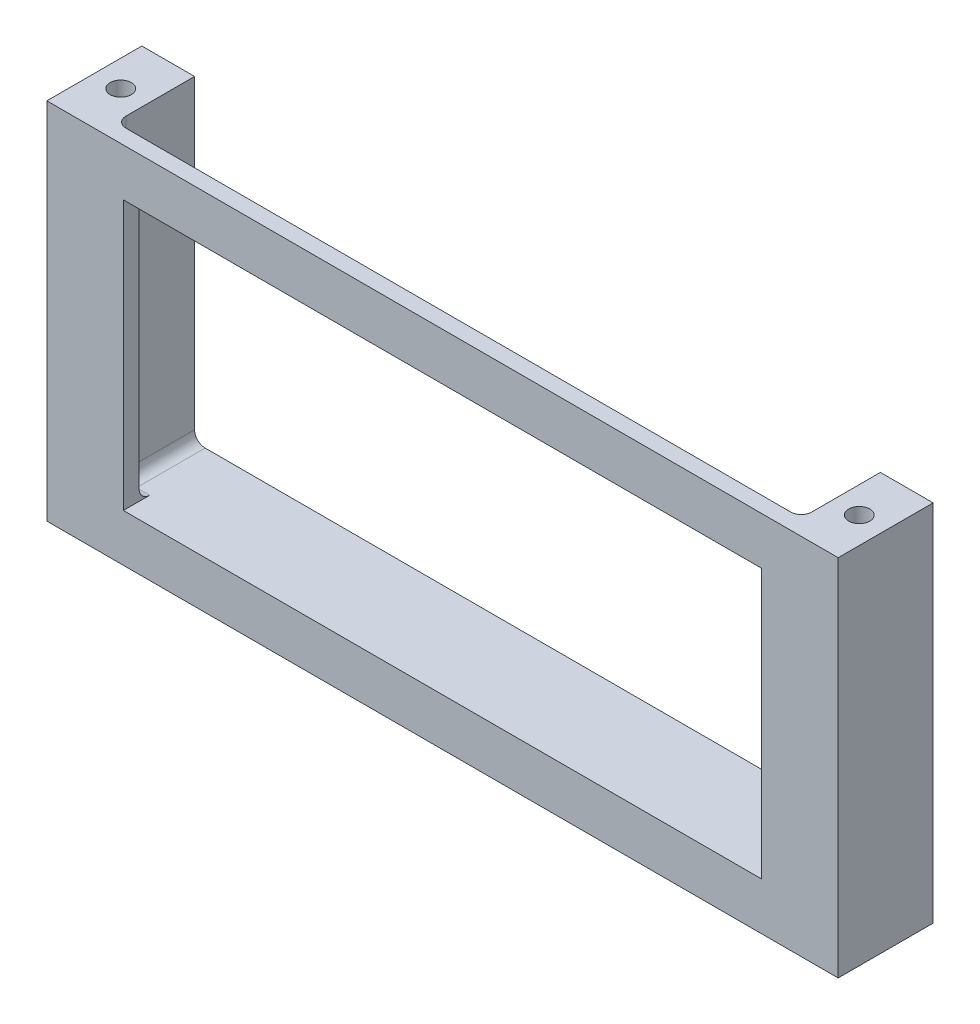
ISO-10303-21;
HEADER;
FILE_DESCRIPTION(('STEP AP214'),'2;1');
FILE_NAME('part.step','',(''),(''),'','','');
FILE_SCHEMA(('AUTOMOTIVE_DESIGN { 1 0 10303 214 1 1 1 1 }'));
ENDSEC;
DATA;
#1=APPLICATION_CONTEXT('core data for automotive mechanical design processes');
#2=APPLICATION_PROTOCOL_DEFINITION('international standard','automotive_design',2000,#1);
#3=PRODUCT_CONTEXT('',#1,'mechanical');
#4=PRODUCT('Part','Part','',(#3));
#5=PRODUCT_RELATED_PRODUCT_CATEGORY('part','',(#4));
#6=PRODUCT_DEFINITION_FORMATION('','',#4);
#7=PRODUCT_DEFINITION_CONTEXT('part definition',#1,'design');
#8=PRODUCT_DEFINITION('design','',#6,#7);
#9=PRODUCT_DEFINITION_SHAPE('','',#8);
#10=(LENGTH_UNIT() NAMED_UNIT(*) SI_UNIT(.MILLI.,.METRE.));
#11=(NAMED_UNIT(*) PLANE_ANGLE_UNIT() SI_UNIT($,.RADIAN.));
#12=(NAMED_UNIT(*) SI_UNIT($,.STERADIAN.) SOLID_ANGLE_UNIT());
#13=UNCERTAINTY_MEASURE_WITH_UNIT(LENGTH_MEASURE(1.E-05),#10,'distance_accuracy_value','');
#14=(GEOMETRIC_REPRESENTATION_CONTEXT(3) GLOBAL_UNCERTAINTY_ASSIGNED_CONTEXT((#13)) GLOBAL_UNIT_ASSIGNED_CONTEXT((#10,
#11,#12)) REPRESENTATION_CONTEXT('',''));
#15=CARTESIAN_POINT('',(0.,0.,0.));
#16=DIRECTION('',(0.,0.,1.));
#17=DIRECTION('',(1.,0.,0.));
#18=AXIS2_PLACEMENT_3D('',#15,#16,#17);
#19=CARTESIAN_POINT('',(65.,69.,1.49999999999999));
#20=DIRECTION('',(0.,0.,-1.));
#21=DIRECTION('',(-1.,0.,0.));
#22=AXIS2_PLACEMENT_3D('',#19,#20,#21);
#23=PLANE('',#22);
#24=DIRECTION('',(0.,1.,0.));
#25=VECTOR('',#24,1.);
#26=CARTESIAN_POINT('',(-75.0000000000001,69.,1.50000000000001));
#27=LINE('',#26,#25);
#28=CARTESIAN_POINT('',(-75.0000000000001,0.,1.50000000000001));
#29=VERTEX_POINT('',#28);
#30=CARTESIAN_POINT('',(-75.0000000000001,69.,1.50000000000001));
#31=VERTEX_POINT('',#30);
#32=EDGE_CURVE('E171',#29,#31,#27,.T.);
#33=ORIENTED_EDGE('',*,*,#32,.F.);
#34=DIRECTION('',(1.,0.,0.));
#35=VECTOR('',#34,1.);
#36=CARTESIAN_POINT('',(65.,0.,1.49999999999999));
#37=LINE('',#36,#35);
#38=CARTESIAN_POINT('',(75.,0.,1.49999999999999));
#39=VERTEX_POINT('',#38);
#40=EDGE_CURVE('E258',#29,#39,#37,.T.);
#41=ORIENTED_EDGE('',*,*,#40,.T.);
#42=DIRECTION('',(0.,-1.,0.));
#43=VECTOR('',#42,1.);
#44=CARTESIAN_POINT('',(75.,0.,1.49999999999999));
#45=LINE('',#44,#43);
#46=CARTESIAN_POINT('',(74.9999999999999,69.,1.49999999999999));
#47=VERTEX_POINT('',#46);
#48=EDGE_CURVE('E174',#47,#39,#45,.T.);
#49=ORIENTED_EDGE('',*,*,#48,.F.);
#50=DIRECTION('',(1.,0.,0.));
#51=VECTOR('',#50,1.);
#52=CARTESIAN_POINT('',(65.,69.,1.49999999999999));
#53=LINE('',#52,#51);
#54=EDGE_CURVE('E268',#31,#47,#53,.T.);
#55=ORIENTED_EDGE('',*,*,#54,.F.);
#56=EDGE_LOOP('',(#33,#41,#49,#55));
#57=FACE_BOUND('',#56,.T.);
#58=DIRECTION('',(1.,0.,0.));
#59=VECTOR('',#58,1.);
#60=CARTESIAN_POINT('',(60.5,9.00000000000002,1.5));
#61=LINE('',#60,#59);
#62=CARTESIAN_POINT('',(-60.5,9.00000000000001,1.50000000000001));
#63=VERTEX_POINT('',#62);
#64=CARTESIAN_POINT('',(60.5,9.00000000000002,1.5));
#65=VERTEX_POINT('',#64);
#66=EDGE_CURVE('E242',#63,#65,#61,.T.);
#67=ORIENTED_EDGE('',*,*,#66,.F.);
#68=DIRECTION('',(0.,-1.,0.));
#69=VECTOR('',#68,1.);
#70=CARTESIAN_POINT('',(-60.5,60.,1.5));
#71=LINE('',#70,#69);
#72=CARTESIAN_POINT('',(-60.5,60.,1.5));
#73=VERTEX_POINT('',#72);
#74=EDGE_CURVE('E228',#73,#63,#71,.T.);
#75=ORIENTED_EDGE('',*,*,#74,.F.);
#76=DIRECTION('',(-1.,0.,0.));
#77=VECTOR('',#76,1.);
#78=CARTESIAN_POINT('',(60.5,60.,1.5));
#79=LINE('',#78,#77);
#80=CARTESIAN_POINT('',(60.5,60.,1.5));
#81=VERTEX_POINT('',#80);
#82=EDGE_CURVE('E250',#81,#73,#79,.T.);
#83=ORIENTED_EDGE('',*,*,#82,.F.);
#84=DIRECTION('',(0.,1.,0.));
#85=VECTOR('',#84,1.);
#86=CARTESIAN_POINT('',(60.5,60.,1.5));
#87=LINE('',#86,#85);
#88=EDGE_CURVE('E246',#65,#81,#87,.T.);
#89=ORIENTED_EDGE('',*,*,#88,.F.);
#90=EDGE_LOOP('',(#67,#75,#83,#89));
#91=FACE_BOUND('',#90,.T.);
#92=ADVANCED_FACE('F41',(#57,#91),#23,.F.);
#93=CARTESIAN_POINT('',(65.,69.,-1.50000000000001));
#94=DIRECTION('',(0.,0.,1.));
#95=DIRECTION('',(1.,0.,0.));
#96=AXIS2_PLACEMENT_3D('',#93,#94,#95);
#97=PLANE('',#96);
#98=DIRECTION('',(0.,-1.,0.));
#99=VECTOR('',#98,1.);
#100=CARTESIAN_POINT('',(-60.5,69.,-1.49999999999999));
#101=LINE('',#100,#99);
#102=CARTESIAN_POINT('',(-60.5,60.,-1.5));
#103=VERTEX_POINT('',#102);
#104=CARTESIAN_POINT('',(-60.5,11.,-1.49999999999999));
#105=VERTEX_POINT('',#104);
#106=EDGE_CURVE('E283',#103,#105,#101,.T.);
#107=ORIENTED_EDGE('',*,*,#106,.T.);
#108=DIRECTION('',(-1.,0.,0.));
#109=VECTOR('',#108,1.);
#110=CARTESIAN_POINT('',(-63.,11.,-1.49999999999999));
#111=LINE('',#110,#109);
#112=CARTESIAN_POINT('',(-63.0000000000001,11.,-1.49999999999999));
#113=VERTEX_POINT('',#112);
#114=EDGE_CURVE('E316',#105,#113,#111,.T.);
#115=ORIENTED_EDGE('',*,*,#114,.T.);
#116=DIRECTION('',(0.,-1.,0.));
#117=VECTOR('',#116,1.);
#118=CARTESIAN_POINT('',(-63.,69.,-1.49999999999999));
#119=LINE('',#118,#117);
#120=CARTESIAN_POINT('',(-63.,69.,-1.49999999999999));
#121=VERTEX_POINT('',#120);
#122=EDGE_CURVE('E313',#113,#121,#119,.F.);
#123=ORIENTED_EDGE('',*,*,#122,.T.);
#124=DIRECTION('',(-1.,0.,0.));
#125=VECTOR('',#124,1.);
#126=CARTESIAN_POINT('',(65.,69.,-1.50000000000001));
#127=LINE('',#126,#125);
#128=CARTESIAN_POINT('',(62.9999999999999,69.,-1.50000000000001));
#129=VERTEX_POINT('',#128);
#130=EDGE_CURVE('E271',#129,#121,#127,.T.);
#131=ORIENTED_EDGE('',*,*,#130,.F.);
#132=DIRECTION('',(0.,-1.,0.));
#133=VECTOR('',#132,1.);
#134=CARTESIAN_POINT('',(62.9999999999999,69.,-1.50000000000001));
#135=LINE('',#134,#133);
#136=CARTESIAN_POINT('',(62.9999999999999,11.,-1.50000000000001));
#137=VERTEX_POINT('',#136);
#138=EDGE_CURVE('E306',#129,#137,#135,.T.);
#139=ORIENTED_EDGE('',*,*,#138,.T.);
#140=DIRECTION('',(-1.,0.,0.));
#141=VECTOR('',#140,1.);
#142=CARTESIAN_POINT('',(60.5,11.,-1.50000000000001));
#143=LINE('',#142,#141);
#144=CARTESIAN_POINT('',(60.5,11.,-1.50000000000001));
#145=VERTEX_POINT('',#144);
#146=EDGE_CURVE('E309',#137,#145,#143,.T.);
#147=ORIENTED_EDGE('',*,*,#146,.T.);
#148=DIRECTION('',(0.,1.,0.));
#149=VECTOR('',#148,1.);
#150=CARTESIAN_POINT('',(60.5,69.,-1.50000000000001));
#151=LINE('',#150,#149);
#152=CARTESIAN_POINT('',(60.5,60.,-1.50000000000001));
#153=VERTEX_POINT('',#152);
#154=EDGE_CURVE('E274',#145,#153,#151,.T.);
#155=ORIENTED_EDGE('',*,*,#154,.T.);
#156=DIRECTION('',(-1.,0.,0.));
#157=VECTOR('',#156,1.);
#158=CARTESIAN_POINT('',(65.,60.,-1.50000000000001));
#159=LINE('',#158,#157);
#160=EDGE_CURVE('E279',#153,#103,#159,.T.);
#161=ORIENTED_EDGE('',*,*,#160,.T.);
#162=EDGE_LOOP('',(#107,#115,#123,#131,#139,#147,#155,#161));
#163=FACE_BOUND('',#162,.T.);
#164=ADVANCED_FACE('F372',(#163),#97,.F.);
#165=CARTESIAN_POINT('',(0.,69.,0.));
#166=DIRECTION('',(0.,-1.,0.));
#167=DIRECTION('',(0.,0.,-1.));
#168=AXIS2_PLACEMENT_3D('',#165,#166,#167);
#169=PLANE('',#168);
#170=CARTESIAN_POINT('',(-70.0000000000001,69.,-7.50000000000001));
#171=DIRECTION('',(0.,1.,0.));
#172=DIRECTION('',(0.,0.,1.));
#173=AXIS2_PLACEMENT_3D('',#170,#171,#172);
#174=CIRCLE('',#173,2.);
#175=CARTESIAN_POINT('',(-70.0000000000001,69.,-5.50000000000001));
#176=VERTEX_POINT('',#175);
#177=EDGE_CURVE('E195',#176,#176,#174,.T.);
#178=ORIENTED_EDGE('',*,*,#177,.F.);
#179=EDGE_LOOP('',(#178));
#180=FACE_BOUND('',#179,.T.);
#181=CARTESIAN_POINT('',(70.0000000000001,69.,-7.50000000000001));
#182=DIRECTION('',(0.,1.,0.));
#183=DIRECTION('',(0.,0.,-1.));
#184=AXIS2_PLACEMENT_3D('',#181,#182,#183);
#185=CIRCLE('',#184,2.);
#186=CARTESIAN_POINT('',(70.0000000000001,69.,-9.50000000000001));
#187=VERTEX_POINT('',#186);
#188=EDGE_CURVE('E198',#187,#187,#185,.T.);
#189=ORIENTED_EDGE('',*,*,#188,.F.);
#190=EDGE_LOOP('',(#189));
#191=FACE_BOUND('',#190,.T.);
#192=DIRECTION('',(0.,0.,-1.));
#193=VECTOR('',#192,1.);
#194=CARTESIAN_POINT('',(64.9999999999999,69.,1.49999999999999));
#195=LINE('',#194,#193);
#196=CARTESIAN_POINT('',(64.9999999999999,69.,-3.50000000000001));
#197=VERTEX_POINT('',#196);
#198=CARTESIAN_POINT('',(64.9999999999999,69.,-16.5));
#199=VERTEX_POINT('',#198);
#200=EDGE_CURVE('E235',#197,#199,#195,.T.);
#201=ORIENTED_EDGE('',*,*,#200,.F.);
#202=CARTESIAN_POINT('',(62.9999999999999,69.,-3.50000000000001));
#203=DIRECTION('',(0.,-1.,0.));
#204=DIRECTION('',(0.,0.,-1.));
#205=AXIS2_PLACEMENT_3D('',#202,#203,#204);
#206=CIRCLE('',#205,2.);
#207=EDGE_CURVE('E11',#197,#129,#206,.T.);
#208=ORIENTED_EDGE('',*,*,#207,.T.);
#209=ORIENTED_EDGE('',*,*,#130,.T.);
#210=CARTESIAN_POINT('',(-63.0000000000001,69.,-3.49999999999999));
#211=DIRECTION('',(0.,-1.,0.));
#212=DIRECTION('',(0.,0.,-1.));
#213=AXIS2_PLACEMENT_3D('',#210,#211,#212);
#214=CIRCLE('',#213,2.);
#215=CARTESIAN_POINT('',(-65.0000000000001,69.,-3.49999999999999));
#216=VERTEX_POINT('',#215);
#217=EDGE_CURVE('E51',#121,#216,#214,.T.);
#218=ORIENTED_EDGE('',*,*,#217,.T.);
#219=DIRECTION('',(0.,0.,-1.));
#220=VECTOR('',#219,1.);
#221=CARTESIAN_POINT('',(-65.0000000000001,69.,1.50000000000001));
#222=LINE('',#221,#220);
#223=CARTESIAN_POINT('',(-65.0000000000001,69.,-16.5));
#224=VERTEX_POINT('',#223);
#225=EDGE_CURVE('E173',#216,#224,#222,.T.);
#226=ORIENTED_EDGE('',*,*,#225,.T.);
#227=DIRECTION('',(1.,0.,0.));
#228=VECTOR('',#227,1.);
#229=CARTESIAN_POINT('',(-65.0000000000001,69.,-16.5));
#230=LINE('',#229,#228);
#231=CARTESIAN_POINT('',(-75.0000000000001,69.,-16.5));
#232=VERTEX_POINT('',#231);
#233=EDGE_CURVE('E177',#232,#224,#230,.T.);
#234=ORIENTED_EDGE('',*,*,#233,.F.);
#235=DIRECTION('',(0.,0.,-1.));
#236=VECTOR('',#235,1.);
#237=CARTESIAN_POINT('',(-75.0000000000001,69.,1.50000000000001));
#238=LINE('',#237,#236);
#239=EDGE_CURVE('E164',#31,#232,#238,.T.);
#240=ORIENTED_EDGE('',*,*,#239,.F.);
#241=ORIENTED_EDGE('',*,*,#54,.T.);
#242=DIRECTION('',(0.,0.,-1.));
#243=VECTOR('',#242,1.);
#244=CARTESIAN_POINT('',(74.9999999999999,69.,1.49999999999999));
#245=LINE('',#244,#243);
#246=CARTESIAN_POINT('',(74.9999999999999,69.,-16.5));
#247=VERTEX_POINT('',#246);
#248=EDGE_CURVE('E232',#47,#247,#245,.T.);
#249=ORIENTED_EDGE('',*,*,#248,.T.);
#250=DIRECTION('',(1.,0.,0.));
#251=VECTOR('',#250,1.);
#252=CARTESIAN_POINT('',(74.9999999999999,69.,-16.5));
#253=LINE('',#252,#251);
#254=EDGE_CURVE('E211',#199,#247,#253,.T.);
#255=ORIENTED_EDGE('',*,*,#254,.F.);
#256=EDGE_LOOP('',(#201,#208,#209,#218,#226,#234,#240,#241,#249,#255));
#257=FACE_BOUND('',#256,.T.);
#258=ADVANCED_FACE('F178',(#180,#191,#257),#169,.F.);
#259=CARTESIAN_POINT('',(0.,0.,0.));
#260=DIRECTION('',(0.,-1.,0.));
#261=DIRECTION('',(0.,0.,-1.));
#262=AXIS2_PLACEMENT_3D('',#259,#260,#261);
#263=PLANE('',#262);
#264=CARTESIAN_POINT('',(-70.0000000000001,0.,-7.50000000000001));
#265=DIRECTION('',(0.,1.,0.));
#266=DIRECTION('',(0.,0.,1.));
#267=AXIS2_PLACEMENT_3D('',#264,#265,#266);
#268=CIRCLE('',#267,2.);
#269=CARTESIAN_POINT('',(-70.0000000000001,0.,-5.50000000000001));
#270=VERTEX_POINT('',#269);
#271=EDGE_CURVE('E191',#270,#270,#268,.T.);
#272=ORIENTED_EDGE('',*,*,#271,.T.);
#273=EDGE_LOOP('',(#272));
#274=FACE_BOUND('',#273,.T.);
#275=CARTESIAN_POINT('',(70.0000000000001,0.,-7.50000000000001));
#276=DIRECTION('',(0.,1.,0.));
#277=DIRECTION('',(0.,0.,-1.));
#278=AXIS2_PLACEMENT_3D('',#275,#276,#277);
#279=CIRCLE('',#278,2.);
#280=CARTESIAN_POINT('',(70.0000000000001,0.,-9.50000000000001));
#281=VERTEX_POINT('',#280);
#282=EDGE_CURVE('E600',#281,#281,#279,.T.);
#283=ORIENTED_EDGE('',*,*,#282,.T.);
#284=EDGE_LOOP('',(#283));
#285=FACE_BOUND('',#284,.T.);
#286=ORIENTED_EDGE('',*,*,#40,.F.);
#287=DIRECTION('',(0.,0.,-1.));
#288=VECTOR('',#287,1.);
#289=CARTESIAN_POINT('',(-75.0000000000001,0.,1.50000000000001));
#290=LINE('',#289,#288);
#291=CARTESIAN_POINT('',(-75.0000000000001,0.,-16.5));
#292=VERTEX_POINT('',#291);
#293=EDGE_CURVE('E225',#29,#292,#290,.T.);
#294=ORIENTED_EDGE('',*,*,#293,.T.);
#295=DIRECTION('',(-1.,0.,0.));
#296=VECTOR('',#295,1.);
#297=CARTESIAN_POINT('',(-75.0000000000001,0.,-16.5));
#298=LINE('',#297,#296);
#299=CARTESIAN_POINT('',(75.,0.,-16.5));
#300=VERTEX_POINT('',#299);
#301=EDGE_CURVE('E189',#300,#292,#298,.T.);
#302=ORIENTED_EDGE('',*,*,#301,.F.);
#303=DIRECTION('',(0.,0.,-1.));
#304=VECTOR('',#303,1.);
#305=CARTESIAN_POINT('',(75.,0.,1.49999999999999));
#306=LINE('',#305,#304);
#307=EDGE_CURVE('E229',#39,#300,#306,.T.);
#308=ORIENTED_EDGE('',*,*,#307,.F.);
#309=EDGE_LOOP('',(#286,#294,#302,#308));
#310=FACE_BOUND('',#309,.T.);
#311=ADVANCED_FACE('F535',(#274,#285,#310),#263,.T.);
#312=CARTESIAN_POINT('',(-60.5,60.,-63.5));
#313=DIRECTION('',(-1.,0.,0.));
#314=DIRECTION('',(0.,-1.,0.));
#315=AXIS2_PLACEMENT_3D('',#312,#313,#314);
#316=PLANE('',#315);
#317=DIRECTION('',(0.,0.,1.));
#318=VECTOR('',#317,1.);
#319=CARTESIAN_POINT('',(-60.5,60.,-63.5));
#320=LINE('',#319,#318);
#321=EDGE_CURVE('E255',#103,#73,#320,.T.);
#322=ORIENTED_EDGE('',*,*,#321,.T.);
#323=ORIENTED_EDGE('',*,*,#74,.T.);
#324=DIRECTION('',(0.,0.,1.));
#325=VECTOR('',#324,1.);
#326=CARTESIAN_POINT('',(-60.5,9.00000000000001,-63.5));
#327=LINE('',#326,#325);
#328=CARTESIAN_POINT('',(-60.5,9.00000000000001,-3.5));
#329=VERTEX_POINT('',#328);
#330=EDGE_CURVE('E254',#329,#63,#327,.T.);
#331=ORIENTED_EDGE('',*,*,#330,.F.);
#332=CARTESIAN_POINT('',(-60.5,11.,-3.49999999999999));
#333=DIRECTION('',(-1.,0.,0.));
#334=DIRECTION('',(0.,-1.,0.));
#335=AXIS2_PLACEMENT_3D('',#332,#333,#334);
#336=CIRCLE('',#335,2.);
#337=EDGE_CURVE('E338',#329,#105,#336,.T.);
#338=ORIENTED_EDGE('',*,*,#337,.T.);
#339=ORIENTED_EDGE('',*,*,#106,.F.);
#340=EDGE_LOOP('',(#322,#323,#331,#338,#339));
#341=FACE_BOUND('',#340,.T.);
#342=ADVANCED_FACE('F530',(#341),#316,.F.);
#343=CARTESIAN_POINT('',(60.5,60.,-63.5));
#344=DIRECTION('',(0.,1.,0.));
#345=DIRECTION('',(-1.,0.,0.));
#346=AXIS2_PLACEMENT_3D('',#343,#344,#345);
#347=PLANE('',#346);
#348=DIRECTION('',(0.,0.,1.));
#349=VECTOR('',#348,1.);
#350=CARTESIAN_POINT('',(60.5,60.,-63.5));
#351=LINE('',#350,#349);
#352=EDGE_CURVE('E259',#153,#81,#351,.T.);
#353=ORIENTED_EDGE('',*,*,#352,.T.);
#354=ORIENTED_EDGE('',*,*,#82,.T.);
#355=ORIENTED_EDGE('',*,*,#321,.F.);
#356=ORIENTED_EDGE('',*,*,#160,.F.);
#357=EDGE_LOOP('',(#353,#354,#355,#356));
#358=FACE_BOUND('',#357,.T.);
#359=ADVANCED_FACE('F522',(#358),#347,.F.);
#360=CARTESIAN_POINT('',(60.5,60.,-63.5));
#361=DIRECTION('',(1.,0.,0.));
#362=DIRECTION('',(0.,1.,0.));
#363=AXIS2_PLACEMENT_3D('',#360,#361,#362);
#364=PLANE('',#363);
#365=DIRECTION('',(0.,0.,1.));
#366=VECTOR('',#365,1.);
#367=CARTESIAN_POINT('',(60.5,9.00000000000002,-63.5));
#368=LINE('',#367,#366);
#369=CARTESIAN_POINT('',(60.5,9.00000000000002,-3.50000000000001));
#370=VERTEX_POINT('',#369);
#371=EDGE_CURVE('E262',#370,#65,#368,.T.);
#372=ORIENTED_EDGE('',*,*,#371,.T.);
#373=ORIENTED_EDGE('',*,*,#88,.T.);
#374=ORIENTED_EDGE('',*,*,#352,.F.);
#375=ORIENTED_EDGE('',*,*,#154,.F.);
#376=CARTESIAN_POINT('',(60.5,11.,-3.50000000000001));
#377=DIRECTION('',(1.,0.,0.));
#378=DIRECTION('',(0.,1.,0.));
#379=AXIS2_PLACEMENT_3D('',#376,#377,#378);
#380=CIRCLE('',#379,2.);
#381=EDGE_CURVE('E341',#145,#370,#380,.T.);
#382=ORIENTED_EDGE('',*,*,#381,.T.);
#383=EDGE_LOOP('',(#372,#373,#374,#375,#382));
#384=FACE_BOUND('',#383,.T.);
#385=ADVANCED_FACE('F405',(#384),#364,.F.);
#386=CARTESIAN_POINT('',(60.5,9.00000000000002,-63.5));
#387=DIRECTION('',(0.,-1.,0.));
#388=DIRECTION('',(1.,0.,0.));
#389=AXIS2_PLACEMENT_3D('',#386,#387,#388);
#390=PLANE('',#389);
#391=DIRECTION('',(0.,0.,-1.));
#392=VECTOR('',#391,1.);
#393=CARTESIAN_POINT('',(-63.0000000000001,9.00000000000001,-63.5));
#394=LINE('',#393,#392);
#395=CARTESIAN_POINT('',(-63.0000000000001,9.00000000000001,-16.5));
#396=VERTEX_POINT('',#395);
#397=CARTESIAN_POINT('',(-63.0000000000001,9.00000000000001,-3.49999999999999));
#398=VERTEX_POINT('',#397);
#399=EDGE_CURVE('E287',#396,#398,#394,.F.);
#400=ORIENTED_EDGE('',*,*,#399,.T.);
#401=DIRECTION('',(-1.,0.,0.));
#402=VECTOR('',#401,1.);
#403=CARTESIAN_POINT('',(-60.5,9.00000000000001,-3.49999999999999));
#404=LINE('',#403,#402);
#405=EDGE_CURVE('E323',#398,#329,#404,.F.);
#406=ORIENTED_EDGE('',*,*,#405,.T.);
#407=ORIENTED_EDGE('',*,*,#330,.T.);
#408=ORIENTED_EDGE('',*,*,#66,.T.);
#409=ORIENTED_EDGE('',*,*,#371,.F.);
#410=DIRECTION('',(-1.,0.,0.));
#411=VECTOR('',#410,1.);
#412=CARTESIAN_POINT('',(62.9999999999999,9.00000000000002,-3.50000000000001));
#413=LINE('',#412,#411);
#414=CARTESIAN_POINT('',(62.9999999999999,9.00000000000002,-3.50000000000001));
#415=VERTEX_POINT('',#414);
#416=EDGE_CURVE('E320',#370,#415,#413,.F.);
#417=ORIENTED_EDGE('',*,*,#416,.T.);
#418=DIRECTION('',(0.,0.,-1.));
#419=VECTOR('',#418,1.);
#420=CARTESIAN_POINT('',(62.9999999999999,9.00000000000002,-63.5));
#421=LINE('',#420,#419);
#422=CARTESIAN_POINT('',(62.9999999999999,9.00000000000001,-16.5));
#423=VERTEX_POINT('',#422);
#424=EDGE_CURVE('E291',#415,#423,#421,.T.);
#425=ORIENTED_EDGE('',*,*,#424,.T.);
#426=DIRECTION('',(1.,0.,0.));
#427=VECTOR('',#426,1.);
#428=CARTESIAN_POINT('',(64.9999999999999,9.00000000000001,-16.5));
#429=LINE('',#428,#427);
#430=EDGE_CURVE('E203',#396,#423,#429,.T.);
#431=ORIENTED_EDGE('',*,*,#430,.F.);
#432=EDGE_LOOP('',(#400,#406,#407,#408,#409,#417,#425,#431));
#433=FACE_BOUND('',#432,.T.);
#434=ADVANCED_FACE('F389',(#433),#390,.F.);
#435=CARTESIAN_POINT('',(64.9999999999999,69.,1.49999999999999));
#436=DIRECTION('',(-1.,0.,0.));
#437=DIRECTION('',(0.,-1.,0.));
#438=AXIS2_PLACEMENT_3D('',#435,#436,#437);
#439=PLANE('',#438);
#440=DIRECTION('',(0.,0.,-1.));
#441=VECTOR('',#440,1.);
#442=CARTESIAN_POINT('',(64.9999999999999,11.,1.49999999999999));
#443=LINE('',#442,#441);
#444=CARTESIAN_POINT('',(64.9999999999999,11.,-16.5));
#445=VERTEX_POINT('',#444);
#446=CARTESIAN_POINT('',(64.9999999999999,11.,-3.50000000000001));
#447=VERTEX_POINT('',#446);
#448=EDGE_CURVE('E294',#445,#447,#443,.F.);
#449=ORIENTED_EDGE('',*,*,#448,.T.);
#450=DIRECTION('',(0.,-1.,0.));
#451=VECTOR('',#450,1.);
#452=CARTESIAN_POINT('',(64.9999999999999,69.,-3.50000000000001));
#453=LINE('',#452,#451);
#454=EDGE_CURVE('E59',#447,#197,#453,.F.);
#455=ORIENTED_EDGE('',*,*,#454,.T.);
#456=ORIENTED_EDGE('',*,*,#200,.T.);
#457=DIRECTION('',(0.,1.,0.));
#458=VECTOR('',#457,1.);
#459=CARTESIAN_POINT('',(64.9999999999999,69.,-16.5));
#460=LINE('',#459,#458);
#461=EDGE_CURVE('E207',#445,#199,#460,.T.);
#462=ORIENTED_EDGE('',*,*,#461,.F.);
#463=EDGE_LOOP('',(#449,#455,#456,#462));
#464=FACE_BOUND('',#463,.T.);
#465=ADVANCED_FACE('F397',(#464),#439,.T.);
#466=CARTESIAN_POINT('',(-65.0000000000001,9.00000000000001,1.50000000000001));
#467=DIRECTION('',(1.,0.,0.));
#468=DIRECTION('',(0.,0.,-1.));
#469=AXIS2_PLACEMENT_3D('',#466,#467,#468);
#470=PLANE('',#469);
#471=ORIENTED_EDGE('',*,*,#225,.F.);
#472=DIRECTION('',(0.,-1.,0.));
#473=VECTOR('',#472,1.);
#474=CARTESIAN_POINT('',(-65.0000000000001,9.00000000000001,-3.49999999999999));
#475=LINE('',#474,#473);
#476=CARTESIAN_POINT('',(-65.0000000000001,11.,-3.49999999999999));
#477=VERTEX_POINT('',#476);
#478=EDGE_CURVE('E333',#216,#477,#475,.T.);
#479=ORIENTED_EDGE('',*,*,#478,.T.);
#480=DIRECTION('',(0.,0.,-1.));
#481=VECTOR('',#480,1.);
#482=CARTESIAN_POINT('',(-65.0000000000001,11.,1.50000000000001));
#483=LINE('',#482,#481);
#484=CARTESIAN_POINT('',(-65.0000000000001,11.,-16.5));
#485=VERTEX_POINT('',#484);
#486=EDGE_CURVE('E297',#477,#485,#483,.T.);
#487=ORIENTED_EDGE('',*,*,#486,.T.);
#488=DIRECTION('',(0.,-1.,0.));
#489=VECTOR('',#488,1.);
#490=CARTESIAN_POINT('',(-65.0000000000001,9.00000000000001,-16.5));
#491=LINE('',#490,#489);
#492=EDGE_CURVE('E183',#224,#485,#491,.T.);
#493=ORIENTED_EDGE('',*,*,#492,.F.);
#494=EDGE_LOOP('',(#471,#479,#487,#493));
#495=FACE_BOUND('',#494,.T.);
#496=ADVANCED_FACE('F382',(#495),#470,.T.);
#497=CARTESIAN_POINT('',(-75.0000000000001,69.,1.50000000000001));
#498=DIRECTION('',(-1.,0.,0.));
#499=DIRECTION('',(0.,-1.,0.));
#500=AXIS2_PLACEMENT_3D('',#497,#498,#499);
#501=PLANE('',#500);
#502=ORIENTED_EDGE('',*,*,#239,.T.);
#503=DIRECTION('',(0.,1.,0.));
#504=VECTOR('',#503,1.);
#505=CARTESIAN_POINT('',(-75.0000000000001,69.,-16.5));
#506=LINE('',#505,#504);
#507=EDGE_CURVE('E169',#292,#232,#506,.T.);
#508=ORIENTED_EDGE('',*,*,#507,.F.);
#509=ORIENTED_EDGE('',*,*,#293,.F.);
#510=ORIENTED_EDGE('',*,*,#32,.T.);
#511=EDGE_LOOP('',(#502,#508,#509,#510));
#512=FACE_BOUND('',#511,.T.);
#513=ADVANCED_FACE('F166',(#512),#501,.T.);
#514=CARTESIAN_POINT('',(75.,0.,1.49999999999999));
#515=DIRECTION('',(1.,0.,0.));
#516=DIRECTION('',(0.,1.,0.));
#517=AXIS2_PLACEMENT_3D('',#514,#515,#516);
#518=PLANE('',#517);
#519=ORIENTED_EDGE('',*,*,#307,.T.);
#520=DIRECTION('',(0.,-1.,0.));
#521=VECTOR('',#520,1.);
#522=CARTESIAN_POINT('',(75.,0.,-16.5));
#523=LINE('',#522,#521);
#524=EDGE_CURVE('E215',#247,#300,#523,.T.);
#525=ORIENTED_EDGE('',*,*,#524,.F.);
#526=ORIENTED_EDGE('',*,*,#248,.F.);
#527=ORIENTED_EDGE('',*,*,#48,.T.);
#528=EDGE_LOOP('',(#519,#525,#526,#527));
#529=FACE_BOUND('',#528,.T.);
#530=ADVANCED_FACE('F484',(#529),#518,.T.);
#531=CARTESIAN_POINT('',(0.,0.,-16.5));
#532=DIRECTION('',(0.,0.,1.));
#533=DIRECTION('',(1.,0.,0.));
#534=AXIS2_PLACEMENT_3D('',#531,#532,#533);
#535=PLANE('',#534);
#536=ORIENTED_EDGE('',*,*,#507,.T.);
#537=ORIENTED_EDGE('',*,*,#233,.T.);
#538=ORIENTED_EDGE('',*,*,#492,.T.);
#539=CARTESIAN_POINT('',(-63.0000000000001,11.,-16.5));
#540=DIRECTION('',(0.,0.,1.));
#541=DIRECTION('',(1.,0.,0.));
#542=AXIS2_PLACEMENT_3D('',#539,#540,#541);
#543=CIRCLE('',#542,2.);
#544=EDGE_CURVE('E303',#485,#396,#543,.T.);
#545=ORIENTED_EDGE('',*,*,#544,.T.);
#546=ORIENTED_EDGE('',*,*,#430,.T.);
#547=CARTESIAN_POINT('',(62.9999999999999,11.,-16.5));
#548=DIRECTION('',(0.,0.,1.));
#549=DIRECTION('',(1.,0.,0.));
#550=AXIS2_PLACEMENT_3D('',#547,#548,#549);
#551=CIRCLE('',#550,2.);
#552=EDGE_CURVE('E300',#423,#445,#551,.T.);
#553=ORIENTED_EDGE('',*,*,#552,.T.);
#554=ORIENTED_EDGE('',*,*,#461,.T.);
#555=ORIENTED_EDGE('',*,*,#254,.T.);
#556=ORIENTED_EDGE('',*,*,#524,.T.);
#557=ORIENTED_EDGE('',*,*,#301,.T.);
#558=EDGE_LOOP('',(#536,#537,#538,#545,#546,#553,#554,#555,#556,#557));
#559=FACE_BOUND('',#558,.T.);
#560=ADVANCED_FACE('F186',(#559),#535,.F.);
#561=CARTESIAN_POINT('',(70.0000000000001,0.,-7.50000000000001));
#562=DIRECTION('',(0.,1.,0.));
#563=DIRECTION('',(0.,0.,1.));
#564=AXIS2_PLACEMENT_3D('',#561,#562,#563);
#565=CYLINDRICAL_SURFACE('',#564,2.);
#566=ORIENTED_EDGE('',*,*,#282,.F.);
#567=EDGE_LOOP('',(#566));
#568=FACE_BOUND('',#567,.T.);
#569=ORIENTED_EDGE('',*,*,#188,.T.);
#570=EDGE_LOOP('',(#569));
#571=FACE_BOUND('',#570,.T.);
#572=ADVANCED_FACE('F468',(#568,#571),#565,.F.);
#573=CARTESIAN_POINT('',(-70.0000000000001,0.,-7.50000000000001));
#574=DIRECTION('',(0.,1.,0.));
#575=DIRECTION('',(0.,0.,1.));
#576=AXIS2_PLACEMENT_3D('',#573,#574,#575);
#577=CYLINDRICAL_SURFACE('',#576,2.);
#578=ORIENTED_EDGE('',*,*,#271,.F.);
#579=EDGE_LOOP('',(#578));
#580=FACE_BOUND('',#579,.T.);
#581=ORIENTED_EDGE('',*,*,#177,.T.);
#582=EDGE_LOOP('',(#581));
#583=FACE_BOUND('',#582,.T.);
#584=ADVANCED_FACE('F420',(#580,#583),#577,.F.);
#585=CARTESIAN_POINT('',(62.9999999999999,11.,-63.5));
#586=DIRECTION('',(0.,0.,-1.));
#587=DIRECTION('',(-1.,0.,0.));
#588=AXIS2_PLACEMENT_3D('',#585,#586,#587);
#589=CYLINDRICAL_SURFACE('',#588,2.);
#590=ORIENTED_EDGE('',*,*,#424,.F.);
#591=CARTESIAN_POINT('',(62.9999999999999,11.,-3.50000000000001));
#592=DIRECTION('',(0.,0.,-1.));
#593=DIRECTION('',(-1.,0.,0.));
#594=AXIS2_PLACEMENT_3D('',#591,#592,#593);
#595=CIRCLE('',#594,2.);
#596=EDGE_CURVE('E330',#415,#447,#595,.F.);
#597=ORIENTED_EDGE('',*,*,#596,.T.);
#598=ORIENTED_EDGE('',*,*,#448,.F.);
#599=ORIENTED_EDGE('',*,*,#552,.F.);
#600=EDGE_LOOP('',(#590,#597,#598,#599));
#601=FACE_BOUND('',#600,.T.);
#602=ADVANCED_FACE('F395',(#601),#589,.F.);
#603=CARTESIAN_POINT('',(-63.0000000000001,11.,1.50000000000001));
#604=DIRECTION('',(0.,0.,-1.));
#605=DIRECTION('',(-1.,0.,0.));
#606=AXIS2_PLACEMENT_3D('',#603,#604,#605);
#607=CYLINDRICAL_SURFACE('',#606,2.);
#608=ORIENTED_EDGE('',*,*,#486,.F.);
#609=CARTESIAN_POINT('',(-63.0000000000001,11.,-3.49999999999999));
#610=DIRECTION('',(0.,0.,-1.));
#611=DIRECTION('',(-1.,0.,0.));
#612=AXIS2_PLACEMENT_3D('',#609,#610,#611);
#613=CIRCLE('',#612,2.);
#614=EDGE_CURVE('E327',#477,#398,#613,.F.);
#615=ORIENTED_EDGE('',*,*,#614,.T.);
#616=ORIENTED_EDGE('',*,*,#399,.F.);
#617=ORIENTED_EDGE('',*,*,#544,.F.);
#618=EDGE_LOOP('',(#608,#615,#616,#617));
#619=FACE_BOUND('',#618,.T.);
#620=ADVANCED_FACE('F385',(#619),#607,.F.);
#621=CARTESIAN_POINT('',(-63.0000000000001,9.00000000000001,-3.49999999999999));
#622=DIRECTION('',(0.,-1.,0.));
#623=DIRECTION('',(0.,0.,-1.));
#624=AXIS2_PLACEMENT_3D('',#621,#622,#623);
#625=CYLINDRICAL_SURFACE('',#624,2.);
#626=CARTESIAN_POINT('',(-63.0000000000001,11.,-3.49999999999999));
#627=DIRECTION('',(0.,1.,0.));
#628=DIRECTION('',(0.,0.,1.));
#629=AXIS2_PLACEMENT_3D('',#626,#627,#628);
#630=CIRCLE('',#629,2.);
#631=EDGE_CURVE('E350',#477,#113,#630,.T.);
#632=ORIENTED_EDGE('',*,*,#631,.F.);
#633=ORIENTED_EDGE('',*,*,#478,.F.);
#634=ORIENTED_EDGE('',*,*,#217,.F.);
#635=ORIENTED_EDGE('',*,*,#122,.F.);
#636=EDGE_LOOP('',(#632,#633,#634,#635));
#637=FACE_BOUND('',#636,.T.);
#638=ADVANCED_FACE('F377',(#637),#625,.F.);
#639=CARTESIAN_POINT('',(-63.0000000000001,11.,-3.49999999999999));
#640=DIRECTION('',(0.,0.,1.));
#641=DIRECTION('',(1.,0.,0.));
#642=AXIS2_PLACEMENT_3D('',#639,#640,#641);
#643=SPHERICAL_SURFACE('',#642,2.);
#644=ORIENTED_EDGE('',*,*,#614,.F.);
#645=ORIENTED_EDGE('',*,*,#631,.T.);
#646=CARTESIAN_POINT('',(-63.0000000000001,11.,-3.49999999999999));
#647=DIRECTION('',(-1.,0.,0.));
#648=DIRECTION('',(0.,0.,1.));
#649=AXIS2_PLACEMENT_3D('',#646,#647,#648);
#650=CIRCLE('',#649,2.);
#651=EDGE_CURVE('E347',#398,#113,#650,.T.);
#652=ORIENTED_EDGE('',*,*,#651,.F.);
#653=EDGE_LOOP('',(#644,#645,#652));
#654=FACE_BOUND('',#653,.T.);
#655=ADVANCED_FACE('F426',(#654),#643,.F.);
#656=CARTESIAN_POINT('',(65.,11.,-3.50000000000001));
#657=DIRECTION('',(1.,0.,0.));
#658=DIRECTION('',(0.,0.,-1.));
#659=AXIS2_PLACEMENT_3D('',#656,#657,#658);
#660=CYLINDRICAL_SURFACE('',#659,2.);
#661=ORIENTED_EDGE('',*,*,#337,.F.);
#662=ORIENTED_EDGE('',*,*,#405,.F.);
#663=ORIENTED_EDGE('',*,*,#651,.T.);
#664=ORIENTED_EDGE('',*,*,#114,.F.);
#665=EDGE_LOOP('',(#661,#662,#663,#664));
#666=FACE_BOUND('',#665,.T.);
#667=ADVANCED_FACE('F423',(#666),#660,.F.);
#668=CARTESIAN_POINT('',(62.9999999999999,69.,-3.50000000000001));
#669=DIRECTION('',(0.,-1.,0.));
#670=DIRECTION('',(1.,0.,0.));
#671=AXIS2_PLACEMENT_3D('',#668,#669,#670);
#672=CYLINDRICAL_SURFACE('',#671,2.);
#673=ORIENTED_EDGE('',*,*,#207,.F.);
#674=ORIENTED_EDGE('',*,*,#454,.F.);
#675=CARTESIAN_POINT('',(62.9999999999999,11.,-3.50000000000001));
#676=DIRECTION('',(0.,1.,0.));
#677=DIRECTION('',(-1.,0.,0.));
#678=AXIS2_PLACEMENT_3D('',#675,#676,#677);
#679=CIRCLE('',#678,2.);
#680=EDGE_CURVE('E45',#137,#447,#679,.T.);
#681=ORIENTED_EDGE('',*,*,#680,.F.);
#682=ORIENTED_EDGE('',*,*,#138,.F.);
#683=EDGE_LOOP('',(#673,#674,#681,#682));
#684=FACE_BOUND('',#683,.T.);
#685=ADVANCED_FACE('F43',(#684),#672,.F.);
#686=CARTESIAN_POINT('',(62.9999999999999,11.,-3.50000000000001));
#687=DIRECTION('',(0.,0.,1.));
#688=DIRECTION('',(1.,0.,0.));
#689=AXIS2_PLACEMENT_3D('',#686,#687,#688);
#690=SPHERICAL_SURFACE('',#689,2.);
#691=ORIENTED_EDGE('',*,*,#680,.T.);
#692=ORIENTED_EDGE('',*,*,#596,.F.);
#693=CARTESIAN_POINT('',(62.9999999999999,11.,-3.50000000000001));
#694=DIRECTION('',(1.,0.,0.));
#695=DIRECTION('',(0.,0.,-1.));
#696=AXIS2_PLACEMENT_3D('',#693,#694,#695);
#697=CIRCLE('',#696,2.);
#698=EDGE_CURVE('E353',#137,#415,#697,.T.);
#699=ORIENTED_EDGE('',*,*,#698,.F.);
#700=EDGE_LOOP('',(#691,#692,#699));
#701=FACE_BOUND('',#700,.T.);
#702=ADVANCED_FACE('F365',(#701),#690,.F.);
#703=CARTESIAN_POINT('',(65.,11.,-3.50000000000001));
#704=DIRECTION('',(1.,0.,0.));
#705=DIRECTION('',(0.,0.,-1.));
#706=AXIS2_PLACEMENT_3D('',#703,#704,#705);
#707=CYLINDRICAL_SURFACE('',#706,2.);
#708=ORIENTED_EDGE('',*,*,#698,.T.);
#709=ORIENTED_EDGE('',*,*,#416,.F.);
#710=ORIENTED_EDGE('',*,*,#381,.F.);
#711=ORIENTED_EDGE('',*,*,#146,.F.);
#712=EDGE_LOOP('',(#708,#709,#710,#711));
#713=FACE_BOUND('',#712,.T.);
#714=ADVANCED_FACE('F433',(#713),#707,.F.);
#715=CLOSED_SHELL('',(#92,#164,#258,#311,#342,#359,#385,#434,#465,#496,#513,#530,#560,#572,#584,
#602,#620,#638,#655,#667,#685,#702,#714));
#716=MANIFOLD_SOLID_BREP('B2',#715);
#717=ADVANCED_BREP_SHAPE_REPRESENTATION('',(#18,#716),#14);
#718=SHAPE_DEFINITION_REPRESENTATION(#9,#717);
ENDSEC;
END-ISO-10303-21;
